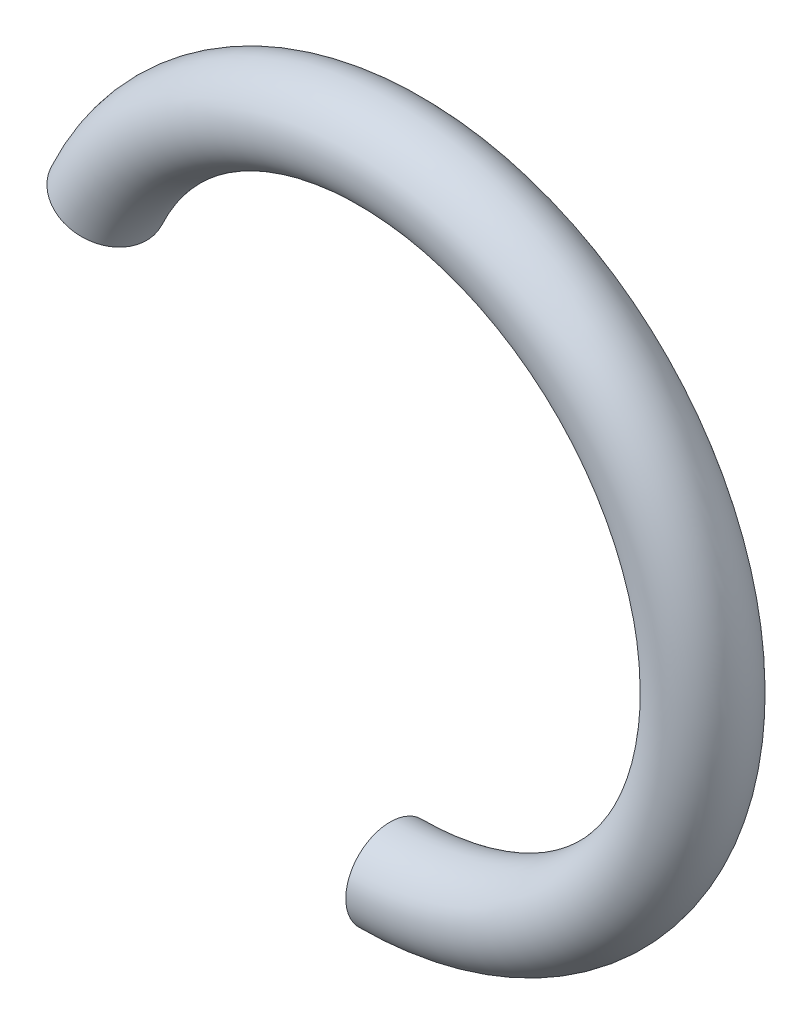
ISO-10303-21;
HEADER;
FILE_DESCRIPTION(('STEP AP214'),'2;1');
FILE_NAME('part.step','',(''),(''),'','','');
FILE_SCHEMA(('AUTOMOTIVE_DESIGN { 1 0 10303 214 1 1 1 1 }'));
ENDSEC;
DATA;
#1=APPLICATION_CONTEXT('core data for automotive mechanical design processes');
#2=APPLICATION_PROTOCOL_DEFINITION('international standard','automotive_design',2000,#1);
#3=PRODUCT_CONTEXT('',#1,'mechanical');
#4=PRODUCT('Part','Part','',(#3));
#5=PRODUCT_RELATED_PRODUCT_CATEGORY('part','',(#4));
#6=PRODUCT_DEFINITION_FORMATION('','',#4);
#7=PRODUCT_DEFINITION_CONTEXT('part definition',#1,'design');
#8=PRODUCT_DEFINITION('design','',#6,#7);
#9=PRODUCT_DEFINITION_SHAPE('','',#8);
#10=(LENGTH_UNIT() NAMED_UNIT(*) SI_UNIT(.MILLI.,.METRE.));
#11=(NAMED_UNIT(*) PLANE_ANGLE_UNIT() SI_UNIT($,.RADIAN.));
#12=(NAMED_UNIT(*) SI_UNIT($,.STERADIAN.) SOLID_ANGLE_UNIT());
#13=UNCERTAINTY_MEASURE_WITH_UNIT(LENGTH_MEASURE(1.E-05),#10,'distance_accuracy_value','');
#14=(GEOMETRIC_REPRESENTATION_CONTEXT(3) GLOBAL_UNCERTAINTY_ASSIGNED_CONTEXT((#13)) GLOBAL_UNIT_ASSIGNED_CONTEXT((#10,
#11,#12)) REPRESENTATION_CONTEXT('',''));
#15=CARTESIAN_POINT('',(0.,0.,0.));
#16=DIRECTION('',(0.,0.,1.));
#17=DIRECTION('',(1.,0.,0.));
#18=AXIS2_PLACEMENT_3D('',#15,#16,#17);
#19=CARTESIAN_POINT('',(0.,-4.6,0.));
#20=DIRECTION('',(1.,0.,0.));
#21=DIRECTION('',(0.,0.,-1.));
#22=AXIS2_PLACEMENT_3D('',#19,#20,#21);
#23=PLANE('',#22);
#24=CARTESIAN_POINT('',(0.,-4.6,0.));
#25=DIRECTION('',(1.,0.,0.));
#26=DIRECTION('',(0.,0.,-1.));
#27=AXIS2_PLACEMENT_3D('',#24,#25,#26);
#28=CIRCLE('',#27,0.65);
#29=CARTESIAN_POINT('',(0.,-5.25,0.));
#30=VERTEX_POINT('',#29);
#31=EDGE_CURVE('E37',#30,#30,#28,.T.);
#32=ORIENTED_EDGE('',*,*,#31,.F.);
#33=EDGE_LOOP('',(#32));
#34=FACE_BOUND('',#33,.T.);
#35=ADVANCED_FACE('F31',(#34),#23,.F.);
#36=CARTESIAN_POINT('',(-4.16901582036858,1.94404400400724,0.));
#37=DIRECTION('',(-0.422618261740704,-0.906307787036648,0.));
#38=DIRECTION('',(0.,0.,-1.));
#39=AXIS2_PLACEMENT_3D('',#36,#37,#38);
#40=PLANE('',#39);
#41=CARTESIAN_POINT('',(-4.16901582036858,1.94404400400724,0.));
#42=DIRECTION('',(-0.422618261740704,-0.906307787036648,0.));
#43=DIRECTION('',(0.,0.,-1.));
#44=AXIS2_PLACEMENT_3D('',#41,#42,#43);
#45=CIRCLE('',#44,0.65);
#46=CARTESIAN_POINT('',(-4.7581158819424,2.21874587413869,0.));
#47=VERTEX_POINT('',#46);
#48=EDGE_CURVE('E10',#47,#47,#45,.T.);
#49=ORIENTED_EDGE('',*,*,#48,.T.);
#50=EDGE_LOOP('',(#49));
#51=FACE_BOUND('',#50,.T.);
#52=ADVANCED_FACE('F46',(#51),#40,.T.);
#53=CARTESIAN_POINT('',(0.,0.,0.));
#54=DIRECTION('',(0.,0.,1.));
#55=DIRECTION('',(1.,0.,0.));
#56=AXIS2_PLACEMENT_3D('',#53,#54,#55);
#57=TOROIDAL_SURFACE('',#56,4.6,0.65);
#58=CARTESIAN_POINT('',(0.,0.,0.));
#59=DIRECTION('',(0.,0.,1.));
#60=DIRECTION('',(1.,0.,0.));
#61=AXIS2_PLACEMENT_3D('',#58,#59,#60);
#62=CIRCLE('',#61,5.25);
#63=EDGE_CURVE('',#30,#47,#62,.T.);
#64=ORIENTED_EDGE('',*,*,#31,.T.);
#65=ORIENTED_EDGE('',*,*,#48,.F.);
#66=ORIENTED_EDGE('',*,*,#63,.T.);
#67=ORIENTED_EDGE('',*,*,#63,.F.);
#68=EDGE_LOOP('',(#64,#66,#65,#67));
#69=FACE_BOUND('',#68,.T.);
#70=ADVANCED_FACE('F43',(#69),#57,.T.);
#71=CLOSED_SHELL('',(#35,#52,#70));
#72=MANIFOLD_SOLID_BREP('B2',#71);
#73=ADVANCED_BREP_SHAPE_REPRESENTATION('',(#18,#72),#14);
#74=SHAPE_DEFINITION_REPRESENTATION(#9,#73);
ENDSEC;
END-ISO-10303-21;
